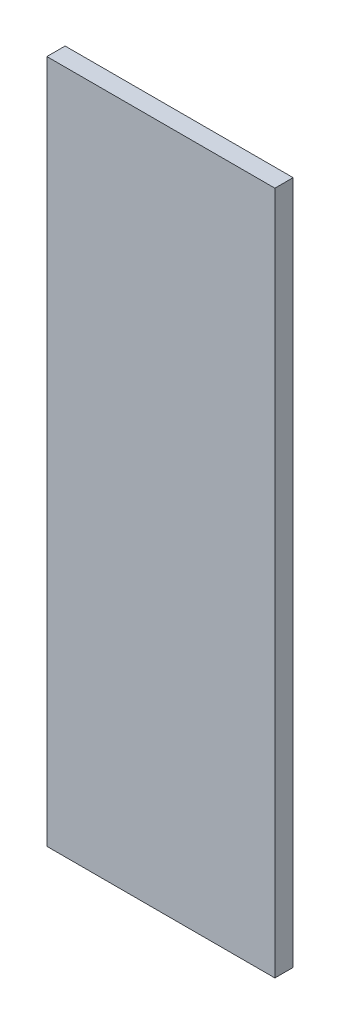
ISO-10303-21;
HEADER;
FILE_DESCRIPTION(('STEP AP214'),'2;1');
FILE_NAME('part.step','',(''),(''),'','','');
FILE_SCHEMA(('AUTOMOTIVE_DESIGN { 1 0 10303 214 1 1 1 1 }'));
ENDSEC;
DATA;
#1=APPLICATION_CONTEXT('core data for automotive mechanical design processes');
#2=APPLICATION_PROTOCOL_DEFINITION('international standard','automotive_design',2000,#1);
#3=PRODUCT_CONTEXT('',#1,'mechanical');
#4=PRODUCT('Part','Part','',(#3));
#5=PRODUCT_RELATED_PRODUCT_CATEGORY('part','',(#4));
#6=PRODUCT_DEFINITION_FORMATION('','',#4);
#7=PRODUCT_DEFINITION_CONTEXT('part definition',#1,'design');
#8=PRODUCT_DEFINITION('design','',#6,#7);
#9=PRODUCT_DEFINITION_SHAPE('','',#8);
#10=(LENGTH_UNIT() NAMED_UNIT(*) SI_UNIT(.MILLI.,.METRE.));
#11=(NAMED_UNIT(*) PLANE_ANGLE_UNIT() SI_UNIT($,.RADIAN.));
#12=(NAMED_UNIT(*) SI_UNIT($,.STERADIAN.) SOLID_ANGLE_UNIT());
#13=UNCERTAINTY_MEASURE_WITH_UNIT(LENGTH_MEASURE(1.E-05),#10,'distance_accuracy_value','');
#14=(GEOMETRIC_REPRESENTATION_CONTEXT(3) GLOBAL_UNCERTAINTY_ASSIGNED_CONTEXT((#13)) GLOBAL_UNIT_ASSIGNED_CONTEXT((#10,
#11,#12)) REPRESENTATION_CONTEXT('',''));
#15=CARTESIAN_POINT('',(0.,0.,0.));
#16=DIRECTION('',(0.,0.,1.));
#17=DIRECTION('',(1.,0.,0.));
#18=AXIS2_PLACEMENT_3D('',#15,#16,#17);
#19=CARTESIAN_POINT('',(0.,0.,4.));
#20=DIRECTION('',(1.,0.,0.));
#21=DIRECTION('',(0.,0.,-1.));
#22=AXIS2_PLACEMENT_3D('',#19,#20,#21);
#23=PLANE('',#22);
#24=DIRECTION('',(0.,-1.,0.));
#25=VECTOR('',#24,1.);
#26=CARTESIAN_POINT('',(0.,0.,0.));
#27=LINE('',#26,#25);
#28=CARTESIAN_POINT('',(0.,150.,0.));
#29=VERTEX_POINT('',#28);
#30=CARTESIAN_POINT('',(0.,0.,0.));
#31=VERTEX_POINT('',#30);
#32=EDGE_CURVE('E100',#29,#31,#27,.T.);
#33=ORIENTED_EDGE('',*,*,#32,.T.);
#34=DIRECTION('',(0.,0.,-1.));
#35=VECTOR('',#34,1.);
#36=CARTESIAN_POINT('',(0.,0.,4.));
#37=LINE('',#36,#35);
#38=CARTESIAN_POINT('',(0.,0.,4.));
#39=VERTEX_POINT('',#38);
#40=EDGE_CURVE('E11',#39,#31,#37,.T.);
#41=ORIENTED_EDGE('',*,*,#40,.F.);
#42=DIRECTION('',(0.,-1.,0.));
#43=VECTOR('',#42,1.);
#44=CARTESIAN_POINT('',(0.,0.,4.));
#45=LINE('',#44,#43);
#46=CARTESIAN_POINT('',(0.,150.,4.));
#47=VERTEX_POINT('',#46);
#48=EDGE_CURVE('E88',#47,#39,#45,.T.);
#49=ORIENTED_EDGE('',*,*,#48,.F.);
#50=DIRECTION('',(0.,0.,-1.));
#51=VECTOR('',#50,1.);
#52=CARTESIAN_POINT('',(0.,150.,4.));
#53=LINE('',#52,#51);
#54=EDGE_CURVE('E96',#47,#29,#53,.T.);
#55=ORIENTED_EDGE('',*,*,#54,.T.);
#56=EDGE_LOOP('',(#33,#41,#49,#55));
#57=FACE_BOUND('',#56,.T.);
#58=ADVANCED_FACE('F37',(#57),#23,.F.);
#59=CARTESIAN_POINT('',(0.,0.,4.));
#60=DIRECTION('',(0.,1.,0.));
#61=DIRECTION('',(0.,0.,1.));
#62=AXIS2_PLACEMENT_3D('',#59,#60,#61);
#63=PLANE('',#62);
#64=DIRECTION('',(1.,0.,0.));
#65=VECTOR('',#64,1.);
#66=CARTESIAN_POINT('',(0.,0.,0.));
#67=LINE('',#66,#65);
#68=CARTESIAN_POINT('',(50.,0.,0.));
#69=VERTEX_POINT('',#68);
#70=EDGE_CURVE('E92',#31,#69,#67,.T.);
#71=ORIENTED_EDGE('',*,*,#70,.T.);
#72=DIRECTION('',(0.,0.,-1.));
#73=VECTOR('',#72,1.);
#74=CARTESIAN_POINT('',(50.,0.,4.));
#75=LINE('',#74,#73);
#76=CARTESIAN_POINT('',(50.,0.,4.));
#77=VERTEX_POINT('',#76);
#78=EDGE_CURVE('E45',#77,#69,#75,.T.);
#79=ORIENTED_EDGE('',*,*,#78,.F.);
#80=DIRECTION('',(1.,0.,0.));
#81=VECTOR('',#80,1.);
#82=CARTESIAN_POINT('',(0.,0.,4.));
#83=LINE('',#82,#81);
#84=EDGE_CURVE('E83',#39,#77,#83,.T.);
#85=ORIENTED_EDGE('',*,*,#84,.F.);
#86=ORIENTED_EDGE('',*,*,#40,.T.);
#87=EDGE_LOOP('',(#71,#79,#85,#86));
#88=FACE_BOUND('',#87,.T.);
#89=ADVANCED_FACE('F91',(#88),#63,.F.);
#90=CARTESIAN_POINT('',(50.,0.,4.));
#91=DIRECTION('',(-1.,0.,0.));
#92=DIRECTION('',(0.,0.,1.));
#93=AXIS2_PLACEMENT_3D('',#90,#91,#92);
#94=PLANE('',#93);
#95=DIRECTION('',(0.,1.,0.));
#96=VECTOR('',#95,1.);
#97=CARTESIAN_POINT('',(50.,0.,0.));
#98=LINE('',#97,#96);
#99=CARTESIAN_POINT('',(50.,150.,0.));
#100=VERTEX_POINT('',#99);
#101=EDGE_CURVE('E70',#69,#100,#98,.T.);
#102=ORIENTED_EDGE('',*,*,#101,.T.);
#103=DIRECTION('',(0.,0.,-1.));
#104=VECTOR('',#103,1.);
#105=CARTESIAN_POINT('',(50.,150.,4.));
#106=LINE('',#105,#104);
#107=CARTESIAN_POINT('',(50.,150.,4.));
#108=VERTEX_POINT('',#107);
#109=EDGE_CURVE('E93',#108,#100,#106,.T.);
#110=ORIENTED_EDGE('',*,*,#109,.F.);
#111=DIRECTION('',(0.,1.,0.));
#112=VECTOR('',#111,1.);
#113=CARTESIAN_POINT('',(50.,0.,4.));
#114=LINE('',#113,#112);
#115=EDGE_CURVE('E86',#77,#108,#114,.T.);
#116=ORIENTED_EDGE('',*,*,#115,.F.);
#117=ORIENTED_EDGE('',*,*,#78,.T.);
#118=EDGE_LOOP('',(#102,#110,#116,#117));
#119=FACE_BOUND('',#118,.T.);
#120=ADVANCED_FACE('F94',(#119),#94,.F.);
#121=CARTESIAN_POINT('',(0.,150.,4.));
#122=DIRECTION('',(0.,-1.,0.));
#123=DIRECTION('',(0.,0.,-1.));
#124=AXIS2_PLACEMENT_3D('',#121,#122,#123);
#125=PLANE('',#124);
#126=DIRECTION('',(-1.,0.,0.));
#127=VECTOR('',#126,1.);
#128=CARTESIAN_POINT('',(0.,150.,0.));
#129=LINE('',#128,#127);
#130=EDGE_CURVE('E76',#100,#29,#129,.T.);
#131=ORIENTED_EDGE('',*,*,#130,.T.);
#132=ORIENTED_EDGE('',*,*,#54,.F.);
#133=DIRECTION('',(-1.,0.,0.));
#134=VECTOR('',#133,1.);
#135=CARTESIAN_POINT('',(0.,150.,4.));
#136=LINE('',#135,#134);
#137=EDGE_CURVE('E53',#108,#47,#136,.T.);
#138=ORIENTED_EDGE('',*,*,#137,.F.);
#139=ORIENTED_EDGE('',*,*,#109,.T.);
#140=EDGE_LOOP('',(#131,#132,#138,#139));
#141=FACE_BOUND('',#140,.T.);
#142=ADVANCED_FACE('F107',(#141),#125,.F.);
#143=CARTESIAN_POINT('',(0.,0.,4.));
#144=DIRECTION('',(0.,0.,-1.));
#145=DIRECTION('',(-1.,0.,0.));
#146=AXIS2_PLACEMENT_3D('',#143,#144,#145);
#147=PLANE('',#146);
#148=ORIENTED_EDGE('',*,*,#48,.T.);
#149=ORIENTED_EDGE('',*,*,#84,.T.);
#150=ORIENTED_EDGE('',*,*,#115,.T.);
#151=ORIENTED_EDGE('',*,*,#137,.T.);
#152=EDGE_LOOP('',(#148,#149,#150,#151));
#153=FACE_BOUND('',#152,.T.);
#154=ADVANCED_FACE('F84',(#153),#147,.F.);
#155=CARTESIAN_POINT('',(0.,0.,0.));
#156=DIRECTION('',(0.,0.,-1.));
#157=DIRECTION('',(-1.,0.,0.));
#158=AXIS2_PLACEMENT_3D('',#155,#156,#157);
#159=PLANE('',#158);
#160=ORIENTED_EDGE('',*,*,#32,.F.);
#161=ORIENTED_EDGE('',*,*,#130,.F.);
#162=ORIENTED_EDGE('',*,*,#101,.F.);
#163=ORIENTED_EDGE('',*,*,#70,.F.);
#164=EDGE_LOOP('',(#160,#161,#162,#163));
#165=FACE_BOUND('',#164,.T.);
#166=ADVANCED_FACE('F110',(#165),#159,.T.);
#167=CLOSED_SHELL('',(#58,#89,#120,#142,#154,#166));
#168=MANIFOLD_SOLID_BREP('B2',#167);
#169=ADVANCED_BREP_SHAPE_REPRESENTATION('',(#18,#168),#14);
#170=SHAPE_DEFINITION_REPRESENTATION(#9,#169);
ENDSEC;
END-ISO-10303-21;
